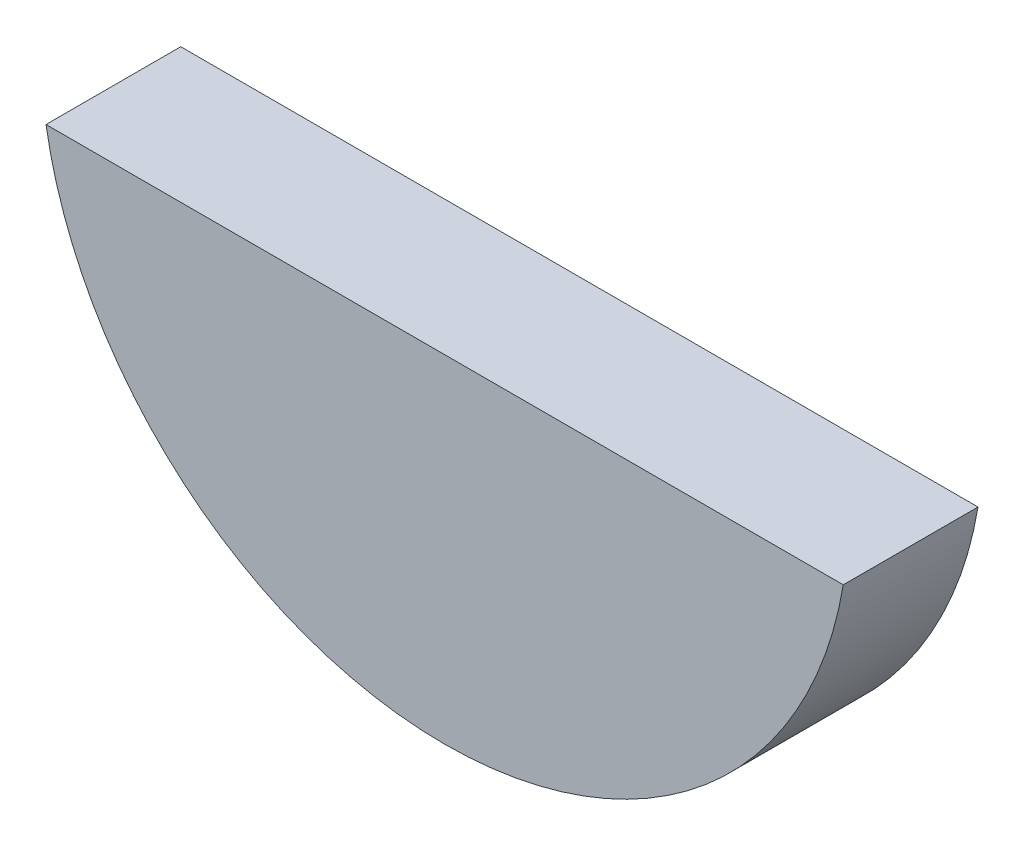
ISO-10303-21;
HEADER;
FILE_DESCRIPTION(('STEP AP214'),'2;1');
FILE_NAME('part.step','',(''),(''),'','','');
FILE_SCHEMA(('AUTOMOTIVE_DESIGN { 1 0 10303 214 1 1 1 1 }'));
ENDSEC;
DATA;
#1=APPLICATION_CONTEXT('core data for automotive mechanical design processes');
#2=APPLICATION_PROTOCOL_DEFINITION('international standard','automotive_design',2000,#1);
#3=PRODUCT_CONTEXT('',#1,'mechanical');
#4=PRODUCT('Part','Part','',(#3));
#5=PRODUCT_RELATED_PRODUCT_CATEGORY('part','',(#4));
#6=PRODUCT_DEFINITION_FORMATION('','',#4);
#7=PRODUCT_DEFINITION_CONTEXT('part definition',#1,'design');
#8=PRODUCT_DEFINITION('design','',#6,#7);
#9=PRODUCT_DEFINITION_SHAPE('','',#8);
#10=(LENGTH_UNIT() NAMED_UNIT(*) SI_UNIT(.MILLI.,.METRE.));
#11=(NAMED_UNIT(*) PLANE_ANGLE_UNIT() SI_UNIT($,.RADIAN.));
#12=(NAMED_UNIT(*) SI_UNIT($,.STERADIAN.) SOLID_ANGLE_UNIT());
#13=UNCERTAINTY_MEASURE_WITH_UNIT(LENGTH_MEASURE(1.E-05),#10,'distance_accuracy_value','');
#14=(GEOMETRIC_REPRESENTATION_CONTEXT(3) GLOBAL_UNCERTAINTY_ASSIGNED_CONTEXT((#13)) GLOBAL_UNIT_ASSIGNED_CONTEXT((#10,
#11,#12)) REPRESENTATION_CONTEXT('',''));
#15=CARTESIAN_POINT('',(0.,0.,0.));
#16=DIRECTION('',(0.,0.,1.));
#17=DIRECTION('',(1.,0.,0.));
#18=AXIS2_PLACEMENT_3D('',#15,#16,#17);
#19=CARTESIAN_POINT('',(0.,0.,1.5875));
#20=DIRECTION('',(0.,0.,-1.));
#21=DIRECTION('',(-1.,0.,0.));
#22=AXIS2_PLACEMENT_3D('',#19,#20,#21);
#23=CYLINDRICAL_SURFACE('',#22,9.525);
#24=CARTESIAN_POINT('',(0.,0.,-1.5875));
#25=DIRECTION('',(0.,0.,1.));
#26=DIRECTION('',(1.,0.,0.));
#27=AXIS2_PLACEMENT_3D('',#24,#25,#26);
#28=CIRCLE('',#27,9.525);
#29=CARTESIAN_POINT('',(-9.39391451738837,-1.5748,-1.5875));
#30=VERTEX_POINT('',#29);
#31=CARTESIAN_POINT('',(9.39391451738837,-1.5748,-1.5875));
#32=VERTEX_POINT('',#31);
#33=EDGE_CURVE('E69',#30,#32,#28,.T.);
#34=ORIENTED_EDGE('',*,*,#33,.T.);
#35=DIRECTION('',(0.,0.,-1.));
#36=VECTOR('',#35,1.);
#37=CARTESIAN_POINT('',(9.39391451738837,-1.5748,1.5875));
#38=LINE('',#37,#36);
#39=CARTESIAN_POINT('',(9.39391451738837,-1.5748,1.5875));
#40=VERTEX_POINT('',#39);
#41=EDGE_CURVE('E11',#40,#32,#38,.T.);
#42=ORIENTED_EDGE('',*,*,#41,.F.);
#43=CARTESIAN_POINT('',(0.,0.,1.5875));
#44=DIRECTION('',(0.,0.,1.));
#45=DIRECTION('',(1.,0.,0.));
#46=AXIS2_PLACEMENT_3D('',#43,#44,#45);
#47=CIRCLE('',#46,9.525);
#48=CARTESIAN_POINT('',(-9.39391451738837,-1.5748,1.5875));
#49=VERTEX_POINT('',#48);
#50=EDGE_CURVE('E68',#49,#40,#47,.T.);
#51=ORIENTED_EDGE('',*,*,#50,.F.);
#52=DIRECTION('',(0.,0.,-1.));
#53=VECTOR('',#52,1.);
#54=CARTESIAN_POINT('',(-9.39391451738837,-1.5748,1.5875));
#55=LINE('',#54,#53);
#56=EDGE_CURVE('E46',#49,#30,#55,.T.);
#57=ORIENTED_EDGE('',*,*,#56,.T.);
#58=EDGE_LOOP('',(#34,#42,#51,#57));
#59=FACE_BOUND('',#58,.T.);
#60=ADVANCED_FACE('F38',(#59),#23,.T.);
#61=CARTESIAN_POINT('',(-9.39391451738837,-1.5748,1.5875));
#62=DIRECTION('',(0.,-1.,0.));
#63=DIRECTION('',(0.,0.,-1.));
#64=AXIS2_PLACEMENT_3D('',#61,#62,#63);
#65=PLANE('',#64);
#66=DIRECTION('',(-1.,0.,0.));
#67=VECTOR('',#66,1.);
#68=CARTESIAN_POINT('',(-9.39391451738837,-1.5748,-1.5875));
#69=LINE('',#68,#67);
#70=EDGE_CURVE('E61',#32,#30,#69,.T.);
#71=ORIENTED_EDGE('',*,*,#70,.T.);
#72=ORIENTED_EDGE('',*,*,#56,.F.);
#73=DIRECTION('',(-1.,0.,0.));
#74=VECTOR('',#73,1.);
#75=CARTESIAN_POINT('',(-9.39391451738837,-1.5748,1.5875));
#76=LINE('',#75,#74);
#77=EDGE_CURVE('E53',#40,#49,#76,.T.);
#78=ORIENTED_EDGE('',*,*,#77,.F.);
#79=ORIENTED_EDGE('',*,*,#41,.T.);
#80=EDGE_LOOP('',(#71,#72,#78,#79));
#81=FACE_BOUND('',#80,.T.);
#82=ADVANCED_FACE('F64',(#81),#65,.F.);
#83=CARTESIAN_POINT('',(0.,0.,1.5875));
#84=DIRECTION('',(0.,0.,1.));
#85=DIRECTION('',(1.,0.,0.));
#86=AXIS2_PLACEMENT_3D('',#83,#84,#85);
#87=PLANE('',#86);
#88=ORIENTED_EDGE('',*,*,#50,.T.);
#89=ORIENTED_EDGE('',*,*,#77,.T.);
#90=EDGE_LOOP('',(#88,#89));
#91=FACE_BOUND('',#90,.T.);
#92=ADVANCED_FACE('F76',(#91),#87,.T.);
#93=CARTESIAN_POINT('',(0.,0.,-1.5875));
#94=DIRECTION('',(0.,0.,1.));
#95=DIRECTION('',(1.,0.,0.));
#96=AXIS2_PLACEMENT_3D('',#93,#94,#95);
#97=PLANE('',#96);
#98=ORIENTED_EDGE('',*,*,#33,.F.);
#99=ORIENTED_EDGE('',*,*,#70,.F.);
#100=EDGE_LOOP('',(#98,#99));
#101=FACE_BOUND('',#100,.T.);
#102=ADVANCED_FACE('F72',(#101),#97,.F.);
#103=CLOSED_SHELL('',(#60,#82,#92,#102));
#104=MANIFOLD_SOLID_BREP('B2',#103);
#105=ADVANCED_BREP_SHAPE_REPRESENTATION('',(#18,#104),#14);
#106=SHAPE_DEFINITION_REPRESENTATION(#9,#105);
ENDSEC;
END-ISO-10303-21;
